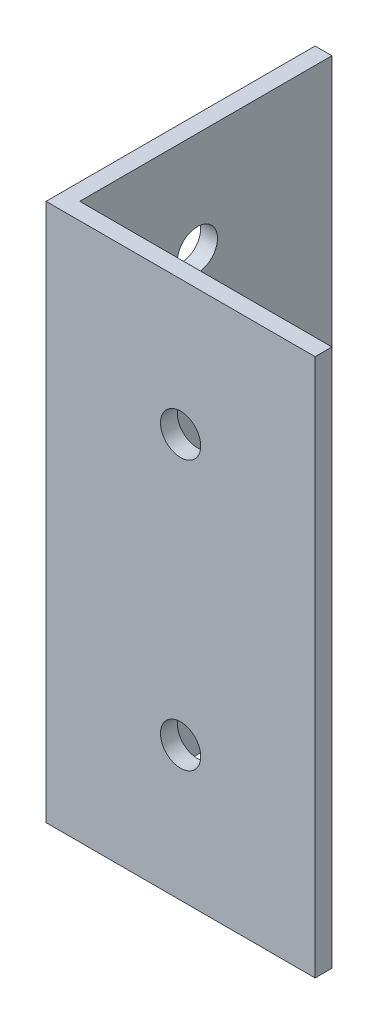
ISO-10303-21;
HEADER;
FILE_DESCRIPTION(('STEP AP214'),'2;1');
FILE_NAME('part.step','',(''),(''),'','','');
FILE_SCHEMA(('AUTOMOTIVE_DESIGN { 1 0 10303 214 1 1 1 1 }'));
ENDSEC;
DATA;
#1=APPLICATION_CONTEXT('core data for automotive mechanical design processes');
#2=APPLICATION_PROTOCOL_DEFINITION('international standard','automotive_design',2000,#1);
#3=PRODUCT_CONTEXT('',#1,'mechanical');
#4=PRODUCT('Part','Part','',(#3));
#5=PRODUCT_RELATED_PRODUCT_CATEGORY('part','',(#4));
#6=PRODUCT_DEFINITION_FORMATION('','',#4);
#7=PRODUCT_DEFINITION_CONTEXT('part definition',#1,'design');
#8=PRODUCT_DEFINITION('design','',#6,#7);
#9=PRODUCT_DEFINITION_SHAPE('','',#8);
#10=(LENGTH_UNIT() NAMED_UNIT(*) SI_UNIT(.MILLI.,.METRE.));
#11=(NAMED_UNIT(*) PLANE_ANGLE_UNIT() SI_UNIT($,.RADIAN.));
#12=(NAMED_UNIT(*) SI_UNIT($,.STERADIAN.) SOLID_ANGLE_UNIT());
#13=UNCERTAINTY_MEASURE_WITH_UNIT(LENGTH_MEASURE(1.E-05),#10,'distance_accuracy_value','');
#14=(GEOMETRIC_REPRESENTATION_CONTEXT(3) GLOBAL_UNCERTAINTY_ASSIGNED_CONTEXT((#13)) GLOBAL_UNIT_ASSIGNED_CONTEXT((#10,
#11,#12)) REPRESENTATION_CONTEXT('',''));
#15=CARTESIAN_POINT('',(0.,0.,0.));
#16=DIRECTION('',(0.,0.,1.));
#17=DIRECTION('',(1.,0.,0.));
#18=AXIS2_PLACEMENT_3D('',#15,#16,#17);
#19=CARTESIAN_POINT('',(0.,50.8,0.));
#20=DIRECTION('',(1.,0.,0.));
#21=DIRECTION('',(0.,0.,-1.));
#22=AXIS2_PLACEMENT_3D('',#19,#20,#21);
#23=PLANE('',#22);
#24=CARTESIAN_POINT('',(0.,41.275,-12.7));
#25=DIRECTION('',(1.,0.,0.));
#26=DIRECTION('',(0.,0.,-1.));
#27=AXIS2_PLACEMENT_3D('',#24,#25,#26);
#28=CIRCLE('',#27,1.89865);
#29=CARTESIAN_POINT('',(0.,41.275,-14.59865));
#30=VERTEX_POINT('',#29);
#31=EDGE_CURVE('E163',#30,#30,#28,.T.);
#32=ORIENTED_EDGE('',*,*,#31,.T.);
#33=EDGE_LOOP('',(#32));
#34=FACE_BOUND('',#33,.T.);
#35=CARTESIAN_POINT('',(0.,9.525,-12.7));
#36=DIRECTION('',(1.,0.,0.));
#37=DIRECTION('',(0.,0.,-1.));
#38=AXIS2_PLACEMENT_3D('',#35,#36,#37);
#39=CIRCLE('',#38,1.89865);
#40=CARTESIAN_POINT('',(0.,9.525,-14.59865));
#41=VERTEX_POINT('',#40);
#42=EDGE_CURVE('E166',#41,#41,#39,.T.);
#43=ORIENTED_EDGE('',*,*,#42,.T.);
#44=EDGE_LOOP('',(#43));
#45=FACE_BOUND('',#44,.T.);
#46=DIRECTION('',(0.,0.,1.));
#47=VECTOR('',#46,1.);
#48=CARTESIAN_POINT('',(0.,0.,0.));
#49=LINE('',#48,#47);
#50=CARTESIAN_POINT('',(0.,0.,-25.4));
#51=VERTEX_POINT('',#50);
#52=CARTESIAN_POINT('',(0.,0.,0.));
#53=VERTEX_POINT('',#52);
#54=EDGE_CURVE('E118',#51,#53,#49,.T.);
#55=ORIENTED_EDGE('',*,*,#54,.T.);
#56=DIRECTION('',(0.,-1.,0.));
#57=VECTOR('',#56,1.);
#58=CARTESIAN_POINT('',(0.,50.8,0.));
#59=LINE('',#58,#57);
#60=CARTESIAN_POINT('',(0.,50.8,0.));
#61=VERTEX_POINT('',#60);
#62=EDGE_CURVE('E11',#61,#53,#59,.T.);
#63=ORIENTED_EDGE('',*,*,#62,.F.);
#64=DIRECTION('',(0.,0.,1.));
#65=VECTOR('',#64,1.);
#66=CARTESIAN_POINT('',(0.,50.8,0.));
#67=LINE('',#66,#65);
#68=CARTESIAN_POINT('',(0.,50.8,-25.4));
#69=VERTEX_POINT('',#68);
#70=EDGE_CURVE('E129',#69,#61,#67,.T.);
#71=ORIENTED_EDGE('',*,*,#70,.F.);
#72=DIRECTION('',(0.,-1.,0.));
#73=VECTOR('',#72,1.);
#74=CARTESIAN_POINT('',(0.,50.8,-25.4));
#75=LINE('',#74,#73);
#76=EDGE_CURVE('E114',#69,#51,#75,.T.);
#77=ORIENTED_EDGE('',*,*,#76,.T.);
#78=EDGE_LOOP('',(#55,#63,#71,#77));
#79=FACE_BOUND('',#78,.T.);
#80=ADVANCED_FACE('F34',(#34,#45,#79),#23,.F.);
#81=CARTESIAN_POINT('',(25.4,50.8,0.));
#82=DIRECTION('',(0.,0.,-1.));
#83=DIRECTION('',(-1.,0.,0.));
#84=AXIS2_PLACEMENT_3D('',#81,#82,#83);
#85=PLANE('',#84);
#86=CARTESIAN_POINT('',(12.7,38.1,0.));
#87=DIRECTION('',(0.,0.,-1.));
#88=DIRECTION('',(-1.,0.,0.));
#89=AXIS2_PLACEMENT_3D('',#86,#87,#88);
#90=CIRCLE('',#89,1.89865);
#91=CARTESIAN_POINT('',(10.80135,38.1,0.));
#92=VERTEX_POINT('',#91);
#93=EDGE_CURVE('E172',#92,#92,#90,.T.);
#94=ORIENTED_EDGE('',*,*,#93,.T.);
#95=EDGE_LOOP('',(#94));
#96=FACE_BOUND('',#95,.T.);
#97=CARTESIAN_POINT('',(12.7,12.7,0.));
#98=DIRECTION('',(0.,0.,-1.));
#99=DIRECTION('',(-1.,0.,0.));
#100=AXIS2_PLACEMENT_3D('',#97,#98,#99);
#101=CIRCLE('',#100,1.89865);
#102=CARTESIAN_POINT('',(10.80135,12.7,0.));
#103=VERTEX_POINT('',#102);
#104=EDGE_CURVE('E122',#103,#103,#101,.T.);
#105=ORIENTED_EDGE('',*,*,#104,.T.);
#106=EDGE_LOOP('',(#105));
#107=FACE_BOUND('',#106,.T.);
#108=DIRECTION('',(1.,0.,0.));
#109=VECTOR('',#108,1.);
#110=CARTESIAN_POINT('',(25.4,0.,0.));
#111=LINE('',#110,#109);
#112=CARTESIAN_POINT('',(25.4,0.,0.));
#113=VERTEX_POINT('',#112);
#114=EDGE_CURVE('E121',#53,#113,#111,.T.);
#115=ORIENTED_EDGE('',*,*,#114,.T.);
#116=DIRECTION('',(0.,-1.,0.));
#117=VECTOR('',#116,1.);
#118=CARTESIAN_POINT('',(25.4,50.8,0.));
#119=LINE('',#118,#117);
#120=CARTESIAN_POINT('',(25.4,50.8,0.));
#121=VERTEX_POINT('',#120);
#122=EDGE_CURVE('E42',#121,#113,#119,.T.);
#123=ORIENTED_EDGE('',*,*,#122,.F.);
#124=DIRECTION('',(1.,0.,0.));
#125=VECTOR('',#124,1.);
#126=CARTESIAN_POINT('',(25.4,50.8,0.));
#127=LINE('',#126,#125);
#128=EDGE_CURVE('E87',#61,#121,#127,.T.);
#129=ORIENTED_EDGE('',*,*,#128,.F.);
#130=ORIENTED_EDGE('',*,*,#62,.T.);
#131=EDGE_LOOP('',(#115,#123,#129,#130));
#132=FACE_BOUND('',#131,.T.);
#133=ADVANCED_FACE('F154',(#96,#107,#132),#85,.F.);
#134=CARTESIAN_POINT('',(25.4,50.8,-1.5875));
#135=DIRECTION('',(-1.,0.,0.));
#136=DIRECTION('',(0.,0.,1.));
#137=AXIS2_PLACEMENT_3D('',#134,#135,#136);
#138=PLANE('',#137);
#139=DIRECTION('',(0.,0.,-1.));
#140=VECTOR('',#139,1.);
#141=CARTESIAN_POINT('',(25.4,0.,-1.5875));
#142=LINE('',#141,#140);
#143=CARTESIAN_POINT('',(25.4,0.,-1.5875));
#144=VERTEX_POINT('',#143);
#145=EDGE_CURVE('E124',#113,#144,#142,.T.);
#146=ORIENTED_EDGE('',*,*,#145,.T.);
#147=DIRECTION('',(0.,-1.,0.));
#148=VECTOR('',#147,1.);
#149=CARTESIAN_POINT('',(25.4,50.8,-1.5875));
#150=LINE('',#149,#148);
#151=CARTESIAN_POINT('',(25.4,50.8,-1.5875));
#152=VERTEX_POINT('',#151);
#153=EDGE_CURVE('E109',#152,#144,#150,.T.);
#154=ORIENTED_EDGE('',*,*,#153,.F.);
#155=DIRECTION('',(0.,0.,-1.));
#156=VECTOR('',#155,1.);
#157=CARTESIAN_POINT('',(25.4,50.8,-1.5875));
#158=LINE('',#157,#156);
#159=EDGE_CURVE('E100',#121,#152,#158,.T.);
#160=ORIENTED_EDGE('',*,*,#159,.F.);
#161=ORIENTED_EDGE('',*,*,#122,.T.);
#162=EDGE_LOOP('',(#146,#154,#160,#161));
#163=FACE_BOUND('',#162,.T.);
#164=ADVANCED_FACE('F135',(#163),#138,.F.);
#165=CARTESIAN_POINT('',(1.5875,50.8,-1.5875));
#166=DIRECTION('',(0.,0.,1.));
#167=DIRECTION('',(1.,0.,0.));
#168=AXIS2_PLACEMENT_3D('',#165,#166,#167);
#169=PLANE('',#168);
#170=CARTESIAN_POINT('',(12.7,38.1,-1.5875));
#171=DIRECTION('',(0.,0.,-1.));
#172=DIRECTION('',(-1.,0.,0.));
#173=AXIS2_PLACEMENT_3D('',#170,#171,#172);
#174=CIRCLE('',#173,1.89864999999999);
#175=CARTESIAN_POINT('',(10.80135,38.1,-1.5875));
#176=VERTEX_POINT('',#175);
#177=EDGE_CURVE('E168',#176,#176,#174,.T.);
#178=ORIENTED_EDGE('',*,*,#177,.F.);
#179=EDGE_LOOP('',(#178));
#180=FACE_BOUND('',#179,.T.);
#181=CARTESIAN_POINT('',(12.7,12.7,-1.5875));
#182=DIRECTION('',(0.,0.,-1.));
#183=DIRECTION('',(-1.,0.,0.));
#184=AXIS2_PLACEMENT_3D('',#181,#182,#183);
#185=CIRCLE('',#184,1.89864999999999);
#186=CARTESIAN_POINT('',(10.80135,12.7,-1.5875));
#187=VERTEX_POINT('',#186);
#188=EDGE_CURVE('E180',#187,#187,#185,.T.);
#189=ORIENTED_EDGE('',*,*,#188,.F.);
#190=EDGE_LOOP('',(#189));
#191=FACE_BOUND('',#190,.T.);
#192=DIRECTION('',(-1.,0.,0.));
#193=VECTOR('',#192,1.);
#194=CARTESIAN_POINT('',(1.5875,0.,-1.5875));
#195=LINE('',#194,#193);
#196=CARTESIAN_POINT('',(1.5875,0.,-1.5875));
#197=VERTEX_POINT('',#196);
#198=EDGE_CURVE('E108',#144,#197,#195,.T.);
#199=ORIENTED_EDGE('',*,*,#198,.T.);
#200=DIRECTION('',(0.,-1.,0.));
#201=VECTOR('',#200,1.);
#202=CARTESIAN_POINT('',(1.5875,50.8,-1.5875));
#203=LINE('',#202,#201);
#204=CARTESIAN_POINT('',(1.5875,50.8,-1.5875));
#205=VERTEX_POINT('',#204);
#206=EDGE_CURVE('E105',#205,#197,#203,.T.);
#207=ORIENTED_EDGE('',*,*,#206,.F.);
#208=DIRECTION('',(-1.,0.,0.));
#209=VECTOR('',#208,1.);
#210=CARTESIAN_POINT('',(1.5875,50.8,-1.5875));
#211=LINE('',#210,#209);
#212=EDGE_CURVE('E94',#152,#205,#211,.T.);
#213=ORIENTED_EDGE('',*,*,#212,.F.);
#214=ORIENTED_EDGE('',*,*,#153,.T.);
#215=EDGE_LOOP('',(#199,#207,#213,#214));
#216=FACE_BOUND('',#215,.T.);
#217=ADVANCED_FACE('F106',(#180,#191,#216),#169,.F.);
#218=CARTESIAN_POINT('',(1.5875,50.8,-25.4));
#219=DIRECTION('',(-1.,0.,0.));
#220=DIRECTION('',(0.,0.,1.));
#221=AXIS2_PLACEMENT_3D('',#218,#219,#220);
#222=PLANE('',#221);
#223=CARTESIAN_POINT('',(1.5875,41.275,-12.7));
#224=DIRECTION('',(1.,0.,0.));
#225=DIRECTION('',(0.,0.,-1.));
#226=AXIS2_PLACEMENT_3D('',#223,#224,#225);
#227=CIRCLE('',#226,1.89864999999999);
#228=CARTESIAN_POINT('',(1.5875,41.275,-14.59865));
#229=VERTEX_POINT('',#228);
#230=EDGE_CURVE('E265',#229,#229,#227,.T.);
#231=ORIENTED_EDGE('',*,*,#230,.F.);
#232=EDGE_LOOP('',(#231));
#233=FACE_BOUND('',#232,.T.);
#234=CARTESIAN_POINT('',(1.5875,9.525,-12.7));
#235=DIRECTION('',(1.,0.,0.));
#236=DIRECTION('',(0.,0.,-1.));
#237=AXIS2_PLACEMENT_3D('',#234,#235,#236);
#238=CIRCLE('',#237,1.89864999999999);
#239=CARTESIAN_POINT('',(1.5875,9.525,-14.59865));
#240=VERTEX_POINT('',#239);
#241=EDGE_CURVE('E169',#240,#240,#238,.T.);
#242=ORIENTED_EDGE('',*,*,#241,.F.);
#243=EDGE_LOOP('',(#242));
#244=FACE_BOUND('',#243,.T.);
#245=DIRECTION('',(0.,0.,-1.));
#246=VECTOR('',#245,1.);
#247=CARTESIAN_POINT('',(1.5875,0.,-25.4));
#248=LINE('',#247,#246);
#249=CARTESIAN_POINT('',(1.5875,0.,-25.4));
#250=VERTEX_POINT('',#249);
#251=EDGE_CURVE('E73',#197,#250,#248,.T.);
#252=ORIENTED_EDGE('',*,*,#251,.T.);
#253=DIRECTION('',(0.,-1.,0.));
#254=VECTOR('',#253,1.);
#255=CARTESIAN_POINT('',(1.5875,50.8,-25.4));
#256=LINE('',#255,#254);
#257=CARTESIAN_POINT('',(1.5875,50.8,-25.4));
#258=VERTEX_POINT('',#257);
#259=EDGE_CURVE('E110',#258,#250,#256,.T.);
#260=ORIENTED_EDGE('',*,*,#259,.F.);
#261=DIRECTION('',(0.,0.,-1.));
#262=VECTOR('',#261,1.);
#263=CARTESIAN_POINT('',(1.5875,50.8,-25.4));
#264=LINE('',#263,#262);
#265=EDGE_CURVE('E98',#205,#258,#264,.T.);
#266=ORIENTED_EDGE('',*,*,#265,.F.);
#267=ORIENTED_EDGE('',*,*,#206,.T.);
#268=EDGE_LOOP('',(#252,#260,#266,#267));
#269=FACE_BOUND('',#268,.T.);
#270=ADVANCED_FACE('F112',(#233,#244,#269),#222,.F.);
#271=CARTESIAN_POINT('',(0.,50.8,-25.4));
#272=DIRECTION('',(0.,0.,1.));
#273=DIRECTION('',(1.,0.,0.));
#274=AXIS2_PLACEMENT_3D('',#271,#272,#273);
#275=PLANE('',#274);
#276=DIRECTION('',(-1.,0.,0.));
#277=VECTOR('',#276,1.);
#278=CARTESIAN_POINT('',(0.,0.,-25.4));
#279=LINE('',#278,#277);
#280=EDGE_CURVE('E79',#250,#51,#279,.T.);
#281=ORIENTED_EDGE('',*,*,#280,.T.);
#282=ORIENTED_EDGE('',*,*,#76,.F.);
#283=DIRECTION('',(-1.,0.,0.));
#284=VECTOR('',#283,1.);
#285=CARTESIAN_POINT('',(0.,50.8,-25.4));
#286=LINE('',#285,#284);
#287=EDGE_CURVE('E50',#258,#69,#286,.T.);
#288=ORIENTED_EDGE('',*,*,#287,.F.);
#289=ORIENTED_EDGE('',*,*,#259,.T.);
#290=EDGE_LOOP('',(#281,#282,#288,#289));
#291=FACE_BOUND('',#290,.T.);
#292=ADVANCED_FACE('F142',(#291),#275,.F.);
#293=CARTESIAN_POINT('',(0.,50.8,0.));
#294=DIRECTION('',(0.,-1.,0.));
#295=DIRECTION('',(0.,0.,-1.));
#296=AXIS2_PLACEMENT_3D('',#293,#294,#295);
#297=PLANE('',#296);
#298=ORIENTED_EDGE('',*,*,#70,.T.);
#299=ORIENTED_EDGE('',*,*,#128,.T.);
#300=ORIENTED_EDGE('',*,*,#159,.T.);
#301=ORIENTED_EDGE('',*,*,#212,.T.);
#302=ORIENTED_EDGE('',*,*,#265,.T.);
#303=ORIENTED_EDGE('',*,*,#287,.T.);
#304=EDGE_LOOP('',(#298,#299,#300,#301,#302,#303));
#305=FACE_BOUND('',#304,.T.);
#306=ADVANCED_FACE('F96',(#305),#297,.F.);
#307=CARTESIAN_POINT('',(0.,0.,0.));
#308=DIRECTION('',(0.,-1.,0.));
#309=DIRECTION('',(0.,0.,-1.));
#310=AXIS2_PLACEMENT_3D('',#307,#308,#309);
#311=PLANE('',#310);
#312=ORIENTED_EDGE('',*,*,#54,.F.);
#313=ORIENTED_EDGE('',*,*,#280,.F.);
#314=ORIENTED_EDGE('',*,*,#251,.F.);
#315=ORIENTED_EDGE('',*,*,#198,.F.);
#316=ORIENTED_EDGE('',*,*,#145,.F.);
#317=ORIENTED_EDGE('',*,*,#114,.F.);
#318=EDGE_LOOP('',(#312,#313,#314,#315,#316,#317));
#319=FACE_BOUND('',#318,.T.);
#320=ADVANCED_FACE('F138',(#319),#311,.T.);
#321=CARTESIAN_POINT('',(12.7,12.7,-1.5875));
#322=DIRECTION('',(0.,0.,-1.));
#323=DIRECTION('',(-1.,0.,0.));
#324=AXIS2_PLACEMENT_3D('',#321,#322,#323);
#325=CYLINDRICAL_SURFACE('',#324,1.89864999999999);
#326=ORIENTED_EDGE('',*,*,#104,.F.);
#327=EDGE_LOOP('',(#326));
#328=FACE_BOUND('',#327,.T.);
#329=ORIENTED_EDGE('',*,*,#188,.T.);
#330=EDGE_LOOP('',(#329));
#331=FACE_BOUND('',#330,.T.);
#332=ADVANCED_FACE('F189',(#328,#331),#325,.F.);
#333=CARTESIAN_POINT('',(12.7,38.1,-1.5875));
#334=DIRECTION('',(0.,0.,-1.));
#335=DIRECTION('',(-1.,0.,0.));
#336=AXIS2_PLACEMENT_3D('',#333,#334,#335);
#337=CYLINDRICAL_SURFACE('',#336,1.89864999999999);
#338=ORIENTED_EDGE('',*,*,#93,.F.);
#339=EDGE_LOOP('',(#338));
#340=FACE_BOUND('',#339,.T.);
#341=ORIENTED_EDGE('',*,*,#177,.T.);
#342=EDGE_LOOP('',(#341));
#343=FACE_BOUND('',#342,.T.);
#344=ADVANCED_FACE('F192',(#340,#343),#337,.F.);
#345=CARTESIAN_POINT('',(1.5875,9.525,-12.7));
#346=DIRECTION('',(1.,0.,0.));
#347=DIRECTION('',(0.,0.,-1.));
#348=AXIS2_PLACEMENT_3D('',#345,#346,#347);
#349=CYLINDRICAL_SURFACE('',#348,1.89864999999999);
#350=ORIENTED_EDGE('',*,*,#42,.F.);
#351=EDGE_LOOP('',(#350));
#352=FACE_BOUND('',#351,.T.);
#353=ORIENTED_EDGE('',*,*,#241,.T.);
#354=EDGE_LOOP('',(#353));
#355=FACE_BOUND('',#354,.T.);
#356=ADVANCED_FACE('F206',(#352,#355),#349,.F.);
#357=CARTESIAN_POINT('',(1.5875,41.275,-12.7));
#358=DIRECTION('',(1.,0.,0.));
#359=DIRECTION('',(0.,0.,-1.));
#360=AXIS2_PLACEMENT_3D('',#357,#358,#359);
#361=CYLINDRICAL_SURFACE('',#360,1.89864999999999);
#362=ORIENTED_EDGE('',*,*,#31,.F.);
#363=EDGE_LOOP('',(#362));
#364=FACE_BOUND('',#363,.T.);
#365=ORIENTED_EDGE('',*,*,#230,.T.);
#366=EDGE_LOOP('',(#365));
#367=FACE_BOUND('',#366,.T.);
#368=ADVANCED_FACE('F212',(#364,#367),#361,.F.);
#369=CLOSED_SHELL('',(#80,#133,#164,#217,#270,#292,#306,#320,#332,#344,#356,#368));
#370=MANIFOLD_SOLID_BREP('B2',#369);
#371=ADVANCED_BREP_SHAPE_REPRESENTATION('',(#18,#370),#14);
#372=SHAPE_DEFINITION_REPRESENTATION(#9,#371);
ENDSEC;
END-ISO-10303-21;
